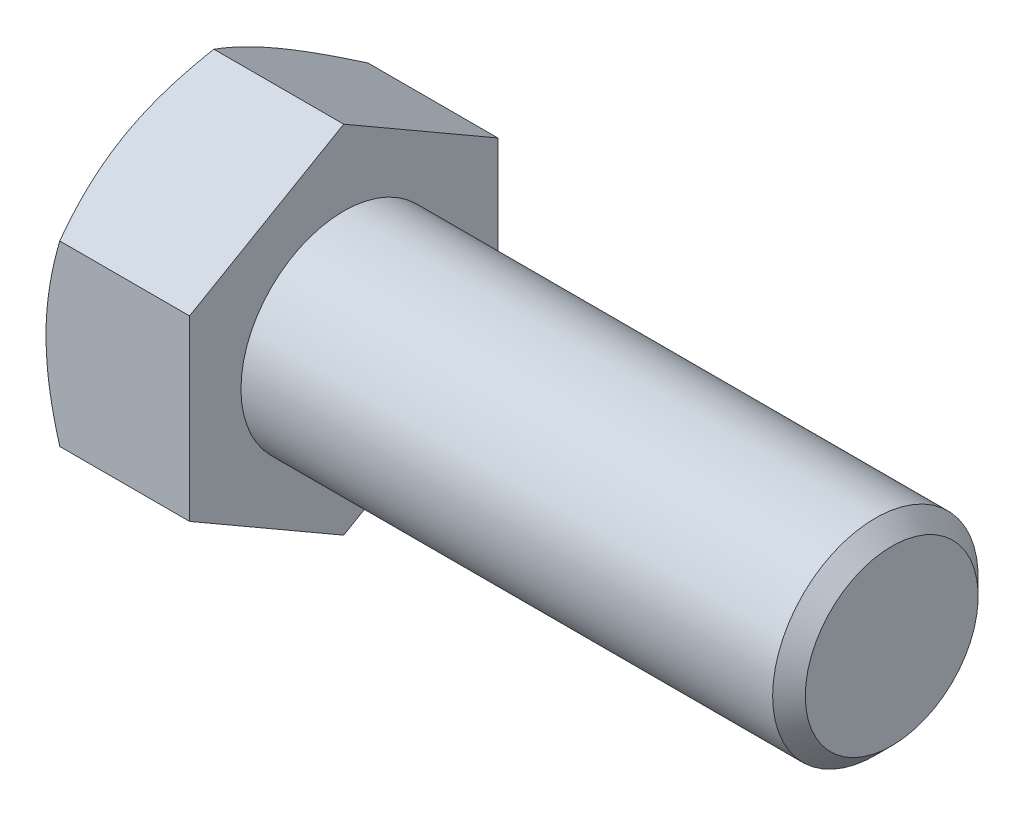
ISO-10303-21;
HEADER;
FILE_DESCRIPTION(('STEP AP214'),'2;1');
FILE_NAME('part.step','',(''),(''),'','','');
FILE_SCHEMA(('AUTOMOTIVE_DESIGN { 1 0 10303 214 1 1 1 1 }'));
ENDSEC;
DATA;
#1=APPLICATION_CONTEXT('core data for automotive mechanical design processes');
#2=APPLICATION_PROTOCOL_DEFINITION('international standard','automotive_design',2000,#1);
#3=PRODUCT_CONTEXT('',#1,'mechanical');
#4=PRODUCT('Part','Part','',(#3));
#5=PRODUCT_RELATED_PRODUCT_CATEGORY('part','',(#4));
#6=PRODUCT_DEFINITION_FORMATION('','',#4);
#7=PRODUCT_DEFINITION_CONTEXT('part definition',#1,'design');
#8=PRODUCT_DEFINITION('design','',#6,#7);
#9=PRODUCT_DEFINITION_SHAPE('','',#8);
#10=(LENGTH_UNIT() NAMED_UNIT(*) SI_UNIT(.MILLI.,.METRE.));
#11=(NAMED_UNIT(*) PLANE_ANGLE_UNIT() SI_UNIT($,.RADIAN.));
#12=(NAMED_UNIT(*) SI_UNIT($,.STERADIAN.) SOLID_ANGLE_UNIT());
#13=UNCERTAINTY_MEASURE_WITH_UNIT(LENGTH_MEASURE(1.E-05),#10,'distance_accuracy_value','');
#14=(GEOMETRIC_REPRESENTATION_CONTEXT(3) GLOBAL_UNCERTAINTY_ASSIGNED_CONTEXT((#13)) GLOBAL_UNIT_ASSIGNED_CONTEXT((#10,
#11,#12)) REPRESENTATION_CONTEXT('',''));
#15=CARTESIAN_POINT('',(0.,0.,0.));
#16=DIRECTION('',(0.,0.,1.));
#17=DIRECTION('',(1.,0.,0.));
#18=AXIS2_PLACEMENT_3D('',#15,#16,#17);
#19=CARTESIAN_POINT('',(13.3096,8.24889197104676,-14.2875));
#20=DIRECTION('',(0.,-0.866025403784438,0.5));
#21=DIRECTION('',(0.,-0.5,-0.866025403784438));
#22=AXIS2_PLACEMENT_3D('',#19,#20,#21);
#23=PLANE('',#22);
#24=CARTESIAN_POINT('',(1.27617469631979,16.4978994121474,0.0002));
#25=CARTESIAN_POINT('',(1.17150354049374,16.316591962665,-0.313833714294311));
#26=CARTESIAN_POINT('',(1.07158215537578,16.1345773166767,-0.629092328867603));
#27=CARTESIAN_POINT('',(0.882559201585302,15.7690884807822,-1.26213756223604));
#28=CARTESIAN_POINT('',(0.793461191524297,15.5856138318553,-1.5799249760784));
#29=CARTESIAN_POINT('',(0.627282646740064,15.2168504028066,-2.21864197116398));
#30=CARTESIAN_POINT('',(0.550230545696848,15.0315583957425,-2.53957714163545));
#31=CARTESIAN_POINT('',(0.409798352887984,14.6596868248225,-3.1836775963594));
#32=CARTESIAN_POINT('',(0.34641748114999,14.4731073350472,-3.50684275230036));
#33=CARTESIAN_POINT('',(0.236023554267064,14.1034416805247,-4.14712244774659));
#34=CARTESIAN_POINT('',(0.188645115273861,13.9203829601652,-4.46418945217785));
#35=CARTESIAN_POINT('',(0.109201912674408,13.5534267067704,-5.0997763272127));
#36=CARTESIAN_POINT('',(0.0771374438271017,13.3695291576584,-5.41829622566206));
#37=CARTESIAN_POINT('',(0.0291317909883664,13.0014251352584,-6.05587109492941));
#38=CARTESIAN_POINT('',(0.0131714475146371,12.8172192908535,-6.37492497648982));
#39=CARTESIAN_POINT('',(-0.00228271550063507,12.448637559964,-7.01332726113215));
#40=CARTESIAN_POINT('',(-0.00177704383827421,12.2642616789095,-7.33267565480881));
#41=CARTESIAN_POINT('',(0.014550680303706,11.9195719861559,-7.92969571550333));
#42=CARTESIAN_POINT('',(0.0283811431962088,11.759233611051,-8.20740992758799));
#43=CARTESIAN_POINT('',(0.0682339694513688,11.4389256760858,-8.76219954501513));
#44=CARTESIAN_POINT('',(0.0942571951847541,11.2789561431174,-9.03927490377954));
#45=CARTESIAN_POINT('',(0.158041814881282,10.9594727825021,-9.59263631653807));
#46=CARTESIAN_POINT('',(0.195812903582825,10.7999594414437,-9.86892152773624));
#47=CARTESIAN_POINT('',(0.28243056247269,10.4816805882453,-10.4201966724507));
#48=CARTESIAN_POINT('',(0.331277885597335,10.3229151276936,-10.6951865166133));
#49=CARTESIAN_POINT('',(0.49566900214655,9.84097374681805,-11.5299334745597));
#50=CARTESIAN_POINT('',(0.627604309461489,9.519193450557,-12.0872732965583));
#51=CARTESIAN_POINT('',(0.927043495545042,8.88043099732143,-13.1936423195297));
#52=CARTESIAN_POINT('',(1.09447704990011,8.56344066203607,-13.7426856857522));
#53=CARTESIAN_POINT('',(1.27617469631978,8.24877650099293,-14.2877));
#54=B_SPLINE_CURVE_WITH_KNOTS('',3,(#24,#25,#26,#27,#28,#29,#30,#31,#32,#33,#34,#35,#36,#37,#38,
#39,#40,#41,#42,#43,#44,#45,#46,#47,#48,#49,#50,#51,#52,#53),.UNSPECIFIED.,.F.,.F.,(4,2,2,2,2,2,
2,2,2,2,2,2,2,2,4),(0.,1.13228866987821,2.26494862244556,3.40024304981971,4.53547268912058,
5.64268215336774,6.74991292800918,7.85582484363026,8.96170258685889,9.92439507576008,
10.8871556643353,11.8507128733959,12.8143356024524,14.7839571212635,16.7497125507192),.UNSPECIFIED.);
#55=CARTESIAN_POINT('',(1.27610802895322,16.4977839420936,0.));
#56=VERTEX_POINT('',#55);
#57=CARTESIAN_POINT('',(0.,12.3733379565702,-7.14375));
#58=VERTEX_POINT('',#57);
#59=EDGE_CURVE('E33',#56,#58,#54,.T.);
#60=ORIENTED_EDGE('',*,*,#59,.F.);
#61=DIRECTION('',(-1.,0.,0.));
#62=VECTOR('',#61,1.);
#63=CARTESIAN_POINT('',(13.3096,16.4977839420936,0.));
#64=LINE('',#63,#62);
#65=CARTESIAN_POINT('',(13.3096,16.4977839420936,0.));
#66=VERTEX_POINT('',#65);
#67=EDGE_CURVE('E129',#66,#56,#64,.T.);
#68=ORIENTED_EDGE('',*,*,#67,.F.);
#69=DIRECTION('',(0.,0.5,0.866025403784438));
#70=VECTOR('',#69,1.);
#71=CARTESIAN_POINT('',(13.3096,8.24889197104676,-14.2875));
#72=LINE('',#71,#70);
#73=CARTESIAN_POINT('',(13.3096,8.24889197104676,-14.2875));
#74=VERTEX_POINT('',#73);
#75=EDGE_CURVE('E214',#74,#66,#72,.T.);
#76=ORIENTED_EDGE('',*,*,#75,.F.);
#77=DIRECTION('',(-1.,0.,0.));
#78=VECTOR('',#77,1.);
#79=CARTESIAN_POINT('',(13.3096,8.24889197104676,-14.2875));
#80=LINE('',#79,#78);
#81=CARTESIAN_POINT('',(1.27610802895321,8.24889197104676,-14.2875));
#82=VERTEX_POINT('',#81);
#83=EDGE_CURVE('E117',#74,#82,#80,.T.);
#84=ORIENTED_EDGE('',*,*,#83,.T.);
#85=EDGE_CURVE('E111',#58,#82,#54,.T.);
#86=ORIENTED_EDGE('',*,*,#85,.F.);
#87=EDGE_LOOP('',(#60,#68,#76,#84,#86));
#88=FACE_BOUND('',#87,.T.);
#89=ADVANCED_FACE('F17',(#88),#23,.F.);
#90=CARTESIAN_POINT('',(13.3096,16.4977839420936,0.));
#91=DIRECTION('',(0.,-0.866025403784438,-0.5));
#92=DIRECTION('',(0.,0.5,-0.866025403784438));
#93=AXIS2_PLACEMENT_3D('',#90,#91,#92);
#94=PLANE('',#93);
#95=CARTESIAN_POINT('',(1.27617469631978,8.24877650099293,14.2877));
#96=CARTESIAN_POINT('',(1.17150354049373,8.43008395047537,13.9736662857057));
#97=CARTESIAN_POINT('',(1.07158215537578,8.61209859646361,13.6584076711324));
#98=CARTESIAN_POINT('',(0.882559201585304,8.97758743235809,13.0253624377639));
#99=CARTESIAN_POINT('',(0.793461191524299,9.16106208128505,12.7075750239216));
#100=CARTESIAN_POINT('',(0.627282646740065,9.5298255103337,12.068858028836));
#101=CARTESIAN_POINT('',(0.55023054569685,9.71511751739782,11.7479228583645));
#102=CARTESIAN_POINT('',(0.409798352887985,10.0869890883179,11.1038224036406));
#103=CARTESIAN_POINT('',(0.346417481149992,10.2735685780931,10.7806572476996));
#104=CARTESIAN_POINT('',(0.236023554267066,10.6432342326156,10.1403775522534));
#105=CARTESIAN_POINT('',(0.188645115273862,10.8262929529751,9.82331054782214));
#106=CARTESIAN_POINT('',(0.10920191267441,11.1932492063699,9.18772367278729));
#107=CARTESIAN_POINT('',(0.0771374438271041,11.3771467554819,8.86920377433793));
#108=CARTESIAN_POINT('',(0.02913179098837,11.7452507778819,8.23162890507058));
#109=CARTESIAN_POINT('',(0.0131714475146414,11.9294566222868,7.91257502351017));
#110=CARTESIAN_POINT('',(-0.00228271550063179,12.2980383531764,7.27417273886784));
#111=CARTESIAN_POINT('',(-0.00177704383827272,12.4824142342309,6.9548243451912));
#112=CARTESIAN_POINT('',(0.0145506803037076,12.8271039269845,6.35780428449668));
#113=CARTESIAN_POINT('',(0.0283811431962119,12.9874423020893,6.08009007241201));
#114=CARTESIAN_POINT('',(0.0682339694513732,13.3077502370545,5.52530045498486));
#115=CARTESIAN_POINT('',(0.0942571951847582,13.4677197700229,5.24822509622045));
#116=CARTESIAN_POINT('',(0.158041814881286,13.7872031306382,4.69486368346192));
#117=CARTESIAN_POINT('',(0.195812903582829,13.9467164716966,4.41857847226376));
#118=CARTESIAN_POINT('',(0.282430562472695,14.264995324895,3.86730332754926));
#119=CARTESIAN_POINT('',(0.331277885597339,14.4237607854467,3.59231348338674));
#120=CARTESIAN_POINT('',(0.495669002146554,14.9057021663223,2.75756652544034));
#121=CARTESIAN_POINT('',(0.627604309461494,15.2274824625833,2.20022670344164));
#122=CARTESIAN_POINT('',(0.927043495545049,15.8662449158189,1.09385768047029));
#123=CARTESIAN_POINT('',(1.09447704990012,16.1832352511043,0.544814314247755));
#124=CARTESIAN_POINT('',(1.27617469631979,16.4978994121474,-0.000200000000001206));
#125=B_SPLINE_CURVE_WITH_KNOTS('',3,(#95,#96,#97,#98,#99,#100,#101,#102,#103,#104,#105,#106,
#107,#108,#109,#110,#111,#112,#113,#114,#115,#116,#117,#118,#119,#120,#121,#122,#123,#124),
.UNSPECIFIED.,.F.,.F.,(4,2,2,2,2,2,2,2,2,2,2,2,2,2,4),(0.,1.1322886698782,2.26494862244556,
3.4002430498197,4.53547268912058,5.64268215336774,6.74991292800917,7.85582484363026,
8.96170258685889,9.92439507576008,10.8871556643353,11.8507128733959,12.8143356024524,
14.7839571212635,16.7497125507192),.UNSPECIFIED.);
#126=CARTESIAN_POINT('',(1.27610802895321,8.24889197104677,14.2875));
#127=VERTEX_POINT('',#126);
#128=CARTESIAN_POINT('',(0.,12.3733379565702,7.14375));
#129=VERTEX_POINT('',#128);
#130=EDGE_CURVE('E40',#127,#129,#125,.T.);
#131=ORIENTED_EDGE('',*,*,#130,.F.);
#132=DIRECTION('',(-1.,0.,0.));
#133=VECTOR('',#132,1.);
#134=CARTESIAN_POINT('',(13.3096,8.24889197104677,14.2875));
#135=LINE('',#134,#133);
#136=CARTESIAN_POINT('',(13.3096,8.24889197104677,14.2875));
#137=VERTEX_POINT('',#136);
#138=EDGE_CURVE('E127',#137,#127,#135,.T.);
#139=ORIENTED_EDGE('',*,*,#138,.F.);
#140=DIRECTION('',(0.,-0.5,0.866025403784438));
#141=VECTOR('',#140,1.);
#142=CARTESIAN_POINT('',(13.3096,16.4977839420936,0.));
#143=LINE('',#142,#141);
#144=EDGE_CURVE('E212',#66,#137,#143,.T.);
#145=ORIENTED_EDGE('',*,*,#144,.F.);
#146=ORIENTED_EDGE('',*,*,#67,.T.);
#147=EDGE_CURVE('E144',#129,#56,#125,.T.);
#148=ORIENTED_EDGE('',*,*,#147,.F.);
#149=EDGE_LOOP('',(#131,#139,#145,#146,#148));
#150=FACE_BOUND('',#149,.T.);
#151=ADVANCED_FACE('F150',(#150),#94,.F.);
#152=CARTESIAN_POINT('',(13.3096,8.24889197104677,14.2875));
#153=DIRECTION('',(0.,0.,-1.));
#154=DIRECTION('',(0.,1.,0.));
#155=AXIS2_PLACEMENT_3D('',#152,#153,#154);
#156=PLANE('',#155);
#157=CARTESIAN_POINT('',(7.08559653091284,-22.3898851403976,14.2875));
#158=CARTESIAN_POINT('',(6.93326774728015,-22.0768961485065,14.2875));
#159=CARTESIAN_POINT('',(6.78168115524726,-21.7635461076253,14.2875));
#160=CARTESIAN_POINT('',(6.48015999479452,-21.1360486675518,14.2875));
#161=CARTESIAN_POINT('',(6.33022544229007,-20.8219012607137,14.2875));
#162=CARTESIAN_POINT('',(5.88311326936992,-19.8780695997121,14.2875));
#163=CARTESIAN_POINT('',(5.5886705911187,-19.2470849579339,14.2875));
#164=CARTESIAN_POINT('',(5.00727922083416,-17.9776461473272,14.2875));
#165=CARTESIAN_POINT('',(4.72037808476412,-17.3391701473184,14.2875));
#166=CARTESIAN_POINT('',(4.15800525940536,-16.0572214756456,14.2875));
#167=CARTESIAN_POINT('',(3.88253304540859,-15.4137490349848,14.2875));
#168=CARTESIAN_POINT('',(3.33703966758479,-14.0991063623122,14.2875));
#169=CARTESIAN_POINT('',(3.06751087102778,-13.427730783812,14.2875));
#170=CARTESIAN_POINT('',(2.5482941470189,-12.0772064856565,14.2875));
#171=CARTESIAN_POINT('',(2.29860841369514,-11.3980569158718,14.2875));
#172=CARTESIAN_POINT('',(1.82546713347175,-10.0321237241471,14.2875));
#173=CARTESIAN_POINT('',(1.60196042520997,-9.34535796384213,14.2875));
#174=CARTESIAN_POINT('',(1.18818152853813,-7.96191308991343,14.2875));
#175=CARTESIAN_POINT('',(0.997899114310357,-7.2652370981213,14.2875));
#176=CARTESIAN_POINT('',(0.744688974538716,-6.21459800125068,14.2875));
#177=CARTESIAN_POINT('',(0.665833592890648,-5.86445181168121,14.2875));
#178=CARTESIAN_POINT('',(0.519775761529065,-5.16172478937003,14.2875));
#179=CARTESIAN_POINT('',(0.452573084094938,-4.80914400434596,14.2875));
#180=CARTESIAN_POINT('',(0.330991997803053,-4.10177331465976,14.2875));
#181=CARTESIAN_POINT('',(0.276613366867468,-3.74698344836219,14.2875));
#182=CARTESIAN_POINT('',(0.181756259237047,-3.03555342863083,14.2875));
#183=CARTESIAN_POINT('',(0.141277163865968,-2.67891335826815,14.2875));
#184=CARTESIAN_POINT('',(0.0755436500454314,-1.96903610663559,14.2875));
#185=CARTESIAN_POINT('',(0.0500928077740657,-1.61581722652351,14.2875));
#186=CARTESIAN_POINT('',(0.0141622343995995,-0.908619532356749,14.2875));
#187=CARTESIAN_POINT('',(0.00368224833251705,-0.554640731346863,14.2875));
#188=CARTESIAN_POINT('',(-0.00205625515740598,0.153442979231275,14.2875));
#189=CARTESIAN_POINT('',(0.00268522427340313,0.507547888773444,14.2875));
#190=CARTESIAN_POINT('',(0.0272712917644393,1.21523734452439,14.2875));
#191=CARTESIAN_POINT('',(0.0471165519035001,1.56882186687579,14.2875));
#192=CARTESIAN_POINT('',(0.11199603107171,2.41165837977563,14.2875));
#193=CARTESIAN_POINT('',(0.163810406450372,2.90039811194564,14.2875));
#194=CARTESIAN_POINT('',(0.293528569466133,3.87440480488912,14.2875));
#195=CARTESIAN_POINT('',(0.371435712647268,4.35967131080168,14.2875));
#196=CARTESIAN_POINT('',(0.550568352001126,5.32621625313485,14.2875));
#197=CARTESIAN_POINT('',(0.651811306760679,5.8074914227673,14.2875));
#198=CARTESIAN_POINT('',(0.87451337427602,6.7652906867346,14.2875));
#199=CARTESIAN_POINT('',(0.995972236678842,7.24181483982839,14.2875));
#200=CARTESIAN_POINT('',(1.259051674178,8.20075205778831,14.2875));
#201=CARTESIAN_POINT('',(1.40106388456013,8.68305692684693,14.2875));
#202=CARTESIAN_POINT('',(1.70023403432787,9.64291929226155,14.2875));
#203=CARTESIAN_POINT('',(1.85739207777891,10.1204767559738,14.2875));
#204=CARTESIAN_POINT('',(2.18431745757465,11.071072312766,14.2875));
#205=CARTESIAN_POINT('',(2.35408093456884,11.5441117394621,14.2875));
#206=CARTESIAN_POINT('',(2.7041737523253,12.4862394675866,14.2875));
#207=CARTESIAN_POINT('',(2.8845029427673,12.955327825119,14.2875));
#208=CARTESIAN_POINT('',(3.33642274249975,14.0985450123052,14.2875));
#209=CARTESIAN_POINT('',(3.61283070485536,14.7707670956111,14.2875));
#210=CARTESIAN_POINT('',(4.17998789378482,16.1091534086177,14.2875));
#211=CARTESIAN_POINT('',(4.47073818030502,16.7753171862674,14.2875));
#212=CARTESIAN_POINT('',(5.06358550000994,18.1027741716843,14.2875));
#213=CARTESIAN_POINT('',(5.36568552575699,18.7640660391257,14.2875));
#214=CARTESIAN_POINT('',(5.97884038094199,20.0824528287766,14.2875));
#215=CARTESIAN_POINT('',(6.28989497805703,20.7395478593321,14.2875));
#216=CARTESIAN_POINT('',(6.91960732570603,22.0510812939212,14.2875));
#217=CARTESIAN_POINT('',(7.23827402908065,22.7055153913756,14.2875));
#218=CARTESIAN_POINT('',(7.88149356008954,24.0114843998787,14.2875));
#219=CARTESIAN_POINT('',(8.20604641853122,24.663019295731,14.2875));
#220=CARTESIAN_POINT('',(8.85994319829524,25.9635553617577,14.2875));
#221=CARTESIAN_POINT('',(9.18928639403452,26.6125568971502,14.2875));
#222=CARTESIAN_POINT('',(9.85199752739624,27.9084978324256,14.2875));
#223=CARTESIAN_POINT('',(10.1853654561409,28.555437236853,14.2875));
#224=CARTESIAN_POINT('',(11.1306522678145,30.3782153849138,14.2875));
#225=CARTESIAN_POINT('',(11.7464658067759,31.5520342270543,14.2875));
#226=CARTESIAN_POINT('',(12.9863637492688,33.8953480220263,14.2875));
#227=CARTESIAN_POINT('',(13.6104484992592,35.0648427910931,14.2875));
#228=CARTESIAN_POINT('',(14.8631697843525,37.3972192211192,14.2875));
#229=CARTESIAN_POINT('',(15.4917889329957,38.5601102267932,14.2875));
#230=CARTESIAN_POINT('',(16.4383496296699,40.3024250307733,14.2875));
#231=CARTESIAN_POINT('',(16.7544655515047,40.8828421143772,14.2875));
#232=CARTESIAN_POINT('',(17.3877853934411,42.0430813057571,14.2875));
#233=CARTESIAN_POINT('',(17.7049893118937,42.6229034144332,14.2875));
#234=CARTESIAN_POINT('',(18.0226732632783,43.2024624684083,14.2875));
#235=B_SPLINE_CURVE_WITH_KNOTS('',3,(#157,#158,#159,#160,#161,#162,#163,#164,#165,#166,#167,
#168,#169,#170,#171,#172,#173,#174,#175,#176,#177,#178,#179,#180,#181,#182,#183,#184,#185,#186,
#187,#188,#189,#190,#191,#192,#193,#194,#195,#196,#197,#198,#199,#200,#201,#202,#203,#204,#205,
#206,#207,#208,#209,#210,#211,#212,#213,#214,#215,#216,#217,#218,#219,#220,#221,#222,#223,#224,
#225,#226,#227,#228,#229,#230,#231,#232,#233,#234),.UNSPECIFIED.,.F.,.F.,(4,2,2,2,2,2,2,2,2,2,2,
2,2,2,2,2,2,2,2,2,2,2,2,2,2,2,2,2,2,2,2,2,2,2,2,2,2,2,4),(0.,1.04426611026884,2.08854227199574,
4.17739185153994,6.27722701936103,8.37696567568248,10.5470989949833,12.7174719418313,
14.8835299683504,17.048920142941,18.1255049291752,19.2020686740974,20.2786137744758,
21.3551109510055,22.4172073060167,23.4792855725806,24.5413636196078,25.6034889291002,
27.0771146749695,28.5509300027185,30.0258515587195,31.5007548507115,33.0087918261306,
34.5168391638508,36.024426678107,37.5319927488533,39.7122554194619,41.8926794609792,
44.0736825017389,46.2546290081198,48.4382809122898,50.6219442487211,52.8052802048644,
54.9886113458608,58.9652044042268,62.9419645611425,66.9077143187838,68.8904689713397,
70.8732206202618),.UNSPECIFIED.);
#236=CARTESIAN_POINT('',(1.27610802895321,-8.24889197104675,14.2875));
#237=VERTEX_POINT('',#236);
#238=CARTESIAN_POINT('',(0.,0.,14.2875));
#239=VERTEX_POINT('',#238);
#240=EDGE_CURVE('E224',#237,#239,#235,.T.);
#241=ORIENTED_EDGE('',*,*,#240,.F.);
#242=DIRECTION('',(-1.,0.,0.));
#243=VECTOR('',#242,1.);
#244=CARTESIAN_POINT('',(13.3096,-8.24889197104675,14.2875));
#245=LINE('',#244,#243);
#246=CARTESIAN_POINT('',(13.3096,-8.24889197104675,14.2875));
#247=VERTEX_POINT('',#246);
#248=EDGE_CURVE('E119',#247,#237,#245,.T.);
#249=ORIENTED_EDGE('',*,*,#248,.F.);
#250=DIRECTION('',(0.,-1.,0.));
#251=VECTOR('',#250,1.);
#252=CARTESIAN_POINT('',(13.3096,8.24889197104677,14.2875));
#253=LINE('',#252,#251);
#254=EDGE_CURVE('E208',#137,#247,#253,.T.);
#255=ORIENTED_EDGE('',*,*,#254,.F.);
#256=ORIENTED_EDGE('',*,*,#138,.T.);
#257=EDGE_CURVE('E166',#239,#127,#235,.T.);
#258=ORIENTED_EDGE('',*,*,#257,.F.);
#259=EDGE_LOOP('',(#241,#249,#255,#256,#258));
#260=FACE_BOUND('',#259,.T.);
#261=ADVANCED_FACE('F230',(#260),#156,.F.);
#262=CARTESIAN_POINT('',(13.3096,-16.4977839420936,0.));
#263=DIRECTION('',(0.,0.866025403784437,-0.5));
#264=DIRECTION('',(0.,0.5,0.866025403784438));
#265=AXIS2_PLACEMENT_3D('',#262,#263,#264);
#266=PLANE('',#265);
#267=CARTESIAN_POINT('',(1.2761746963198,-16.4978994121474,-0.000200000000000067));
#268=CARTESIAN_POINT('',(1.17150354049374,-16.316591962665,0.313833714294313));
#269=CARTESIAN_POINT('',(1.07158215537578,-16.1345773166767,0.629092328867605));
#270=CARTESIAN_POINT('',(0.882559201585305,-15.7690884807822,1.26213756223604));
#271=CARTESIAN_POINT('',(0.7934611915243,-15.5856138318553,1.5799249760784));
#272=CARTESIAN_POINT('',(0.627282646740067,-15.2168504028066,2.21864197116397));
#273=CARTESIAN_POINT('',(0.550230545696852,-15.0315583957425,2.53957714163545));
#274=CARTESIAN_POINT('',(0.409798352887987,-14.6596868248225,3.1836775963594));
#275=CARTESIAN_POINT('',(0.346417481149993,-14.4731073350472,3.50684275230035));
#276=CARTESIAN_POINT('',(0.236023554267066,-14.1034416805247,4.14712244774659));
#277=CARTESIAN_POINT('',(0.188645115273863,-13.9203829601652,4.46418945217785));
#278=CARTESIAN_POINT('',(0.109201912674409,-13.5534267067704,5.0997763272127));
#279=CARTESIAN_POINT('',(0.0771374438271033,-13.3695291576584,5.41829622566206));
#280=CARTESIAN_POINT('',(0.0291317909883688,-13.0014251352584,6.05587109492941));
#281=CARTESIAN_POINT('',(0.01317144751464,-12.8172192908535,6.37492497648982));
#282=CARTESIAN_POINT('',(-0.00228271550063391,-12.448637559964,7.01332726113215));
#283=CARTESIAN_POINT('',(-0.00177704383827524,-12.2642616789095,7.3326756548088));
#284=CARTESIAN_POINT('',(0.0145506803037046,-11.9195719861559,7.92969571550332));
#285=CARTESIAN_POINT('',(0.0283811431962088,-11.759233611051,8.20740992758799));
#286=CARTESIAN_POINT('',(0.0682339694513693,-11.4389256760858,8.76219954501513));
#287=CARTESIAN_POINT('',(0.0942571951847536,-11.2789561431174,9.03927490377953));
#288=CARTESIAN_POINT('',(0.15804181488128,-10.9594727825021,9.59263631653807));
#289=CARTESIAN_POINT('',(0.195812903582824,-10.7999594414437,9.86892152773623));
#290=CARTESIAN_POINT('',(0.282430562472689,-10.4816805882453,10.4201966724507));
#291=CARTESIAN_POINT('',(0.331277885597334,-10.3229151276936,10.6951865166133));
#292=CARTESIAN_POINT('',(0.495669002146551,-9.84097374681805,11.5299334745597));
#293=CARTESIAN_POINT('',(0.627604309461491,-9.519193450557,12.0872732965584));
#294=CARTESIAN_POINT('',(0.927043495545044,-8.88043099732142,13.1936423195297));
#295=CARTESIAN_POINT('',(1.09447704990011,-8.56344066203606,13.7426856857522));
#296=CARTESIAN_POINT('',(1.27617469631978,-8.24877650099291,14.2877));
#297=B_SPLINE_CURVE_WITH_KNOTS('',3,(#267,#268,#269,#270,#271,#272,#273,#274,#275,#276,#277,
#278,#279,#280,#281,#282,#283,#284,#285,#286,#287,#288,#289,#290,#291,#292,#293,#294,#295,#296),
.UNSPECIFIED.,.F.,.F.,(4,2,2,2,2,2,2,2,2,2,2,2,2,2,4),(0.,1.1322886698782,2.26494862244556,
3.4002430498197,4.53547268912058,5.64268215336774,6.74991292800917,7.85582484363026,
8.96170258685889,9.92439507576008,10.8871556643353,11.8507128733959,12.8143356024524,
14.7839571212635,16.7497125507192),.UNSPECIFIED.);
#298=CARTESIAN_POINT('',(1.27610802895322,-16.4977839420936,0.));
#299=VERTEX_POINT('',#298);
#300=CARTESIAN_POINT('',(0.,-12.3733379565701,7.14375));
#301=VERTEX_POINT('',#300);
#302=EDGE_CURVE('E152',#299,#301,#297,.T.);
#303=ORIENTED_EDGE('',*,*,#302,.F.);
#304=DIRECTION('',(-1.,0.,0.));
#305=VECTOR('',#304,1.);
#306=CARTESIAN_POINT('',(13.3096,-16.4977839420936,0.));
#307=LINE('',#306,#305);
#308=CARTESIAN_POINT('',(13.3096,-16.4977839420936,0.));
#309=VERTEX_POINT('',#308);
#310=EDGE_CURVE('E116',#309,#299,#307,.T.);
#311=ORIENTED_EDGE('',*,*,#310,.F.);
#312=DIRECTION('',(0.,-0.5,-0.866025403784438));
#313=VECTOR('',#312,1.);
#314=CARTESIAN_POINT('',(13.3096,-16.4977839420936,0.));
#315=LINE('',#314,#313);
#316=EDGE_CURVE('E206',#247,#309,#315,.T.);
#317=ORIENTED_EDGE('',*,*,#316,.F.);
#318=ORIENTED_EDGE('',*,*,#248,.T.);
#319=EDGE_CURVE('E154',#301,#237,#297,.T.);
#320=ORIENTED_EDGE('',*,*,#319,.F.);
#321=EDGE_LOOP('',(#303,#311,#317,#318,#320));
#322=FACE_BOUND('',#321,.T.);
#323=ADVANCED_FACE('F202',(#322),#266,.F.);
#324=CARTESIAN_POINT('',(13.3096,-8.2488919710468,-14.2875));
#325=DIRECTION('',(0.,0.866025403784439,0.5));
#326=DIRECTION('',(0.,-0.5,0.866025403784439));
#327=AXIS2_PLACEMENT_3D('',#324,#325,#326);
#328=PLANE('',#327);
#329=CARTESIAN_POINT('',(1.27617469631979,-8.24877650099296,-14.2877));
#330=CARTESIAN_POINT('',(1.17150354049374,-8.4300839504754,-13.9736662857057));
#331=CARTESIAN_POINT('',(1.07158215537579,-8.61209859646364,-13.6584076711324));
#332=CARTESIAN_POINT('',(0.882559201585316,-8.97758743235812,-13.0253624377639));
#333=CARTESIAN_POINT('',(0.79346119152431,-9.16106208128508,-12.7075750239216));
#334=CARTESIAN_POINT('',(0.627282646740076,-9.52982551033373,-12.068858028836));
#335=CARTESIAN_POINT('',(0.550230545696861,-9.71511751739785,-11.7479228583645));
#336=CARTESIAN_POINT('',(0.409798352887998,-10.0869890883179,-11.1038224036406));
#337=CARTESIAN_POINT('',(0.346417481150006,-10.2735685780931,-10.7806572476996));
#338=CARTESIAN_POINT('',(0.23602355426708,-10.6432342326156,-10.1403775522534));
#339=CARTESIAN_POINT('',(0.188645115273876,-10.8262929529752,-9.82331054782214));
#340=CARTESIAN_POINT('',(0.109201912674422,-11.1932492063699,-9.18772367278729));
#341=CARTESIAN_POINT('',(0.0771374438271171,-11.3771467554819,-8.86920377433793));
#342=CARTESIAN_POINT('',(0.0291317909883845,-11.745250777882,-8.23162890507058));
#343=CARTESIAN_POINT('',(0.013171447514657,-11.9294566222869,-7.91257502351018));
#344=CARTESIAN_POINT('',(-0.00228271550061935,-12.2980383531764,-7.27417273886784));
#345=CARTESIAN_POINT('',(-0.00177704383826439,-12.4824142342309,-6.95482434519119));
#346=CARTESIAN_POINT('',(0.0145506803037171,-12.8271039269845,-6.35780428449667));
#347=CARTESIAN_POINT('',(0.0283811431962256,-12.9874423020893,-6.08009007241201));
#348=CARTESIAN_POINT('',(0.0682339694513894,-13.3077502370545,-5.52530045498487));
#349=CARTESIAN_POINT('',(0.0942571951847727,-13.4677197700229,-5.24822509622046));
#350=CARTESIAN_POINT('',(0.158041814881299,-13.7872031306382,-4.69486368346193));
#351=CARTESIAN_POINT('',(0.195812903582843,-13.9467164716966,-4.41857847226376));
#352=CARTESIAN_POINT('',(0.282430562472708,-14.2649953248951,-3.86730332754927));
#353=CARTESIAN_POINT('',(0.331277885597352,-14.4237607854467,-3.59231348338674));
#354=CARTESIAN_POINT('',(0.495669002146568,-14.9057021663223,-2.75756652544035));
#355=CARTESIAN_POINT('',(0.627604309461508,-15.2274824625833,-2.20022670344165));
#356=CARTESIAN_POINT('',(0.92704349554506,-15.8662449158189,-1.0938576804703));
#357=CARTESIAN_POINT('',(1.09447704990012,-16.1832352511043,-0.544814314247761));
#358=CARTESIAN_POINT('',(1.2761746963198,-16.4978994121474,0.000200000000000622));
#359=B_SPLINE_CURVE_WITH_KNOTS('',3,(#329,#330,#331,#332,#333,#334,#335,#336,#337,#338,#339,
#340,#341,#342,#343,#344,#345,#346,#347,#348,#349,#350,#351,#352,#353,#354,#355,#356,#357,#358),
.UNSPECIFIED.,.F.,.F.,(4,2,2,2,2,2,2,2,2,2,2,2,2,2,4),(0.,1.1322886698782,2.26494862244556,
3.4002430498197,4.53547268912058,5.64268215336774,6.74991292800917,7.85582484363026,
8.96170258685888,9.92439507576007,10.8871556643353,11.8507128733959,12.8143356024524,
14.7839571212635,16.7497125507192),.UNSPECIFIED.);
#360=CARTESIAN_POINT('',(1.27610802895322,-8.2488919710468,-14.2875));
#361=VERTEX_POINT('',#360);
#362=CARTESIAN_POINT('',(0.,-12.3733379565702,-7.14375));
#363=VERTEX_POINT('',#362);
#364=EDGE_CURVE('E93',#361,#363,#359,.T.);
#365=ORIENTED_EDGE('',*,*,#364,.F.);
#366=DIRECTION('',(-1.,0.,0.));
#367=VECTOR('',#366,1.);
#368=CARTESIAN_POINT('',(13.3096,-8.2488919710468,-14.2875));
#369=LINE('',#368,#367);
#370=CARTESIAN_POINT('',(13.3096,-8.2488919710468,-14.2875));
#371=VERTEX_POINT('',#370);
#372=EDGE_CURVE('E107',#371,#361,#369,.T.);
#373=ORIENTED_EDGE('',*,*,#372,.F.);
#374=DIRECTION('',(0.,0.5,-0.866025403784439));
#375=VECTOR('',#374,1.);
#376=CARTESIAN_POINT('',(13.3096,-8.2488919710468,-14.2875));
#377=LINE('',#376,#375);
#378=EDGE_CURVE('E204',#309,#371,#377,.T.);
#379=ORIENTED_EDGE('',*,*,#378,.F.);
#380=ORIENTED_EDGE('',*,*,#310,.T.);
#381=EDGE_CURVE('E110',#363,#299,#359,.T.);
#382=ORIENTED_EDGE('',*,*,#381,.F.);
#383=EDGE_LOOP('',(#365,#373,#379,#380,#382));
#384=FACE_BOUND('',#383,.T.);
#385=ADVANCED_FACE('F105',(#384),#328,.F.);
#386=CARTESIAN_POINT('',(13.3096,8.24889197104676,-14.2875));
#387=DIRECTION('',(0.,0.,1.));
#388=DIRECTION('',(0.,-1.,0.));
#389=AXIS2_PLACEMENT_3D('',#386,#387,#388);
#390=PLANE('',#389);
#391=CARTESIAN_POINT('',(7.08559653091287,-22.3898851403977,-14.2875));
#392=CARTESIAN_POINT('',(6.93326774728018,-22.0768961485065,-14.2875));
#393=CARTESIAN_POINT('',(6.78168115524728,-21.7635461076253,-14.2875));
#394=CARTESIAN_POINT('',(6.48015999479454,-21.1360486675519,-14.2875));
#395=CARTESIAN_POINT('',(6.3302254422901,-20.8219012607137,-14.2875));
#396=CARTESIAN_POINT('',(5.88311326936994,-19.8780695997121,-14.2875));
#397=CARTESIAN_POINT('',(5.58867059111872,-19.247084957934,-14.2875));
#398=CARTESIAN_POINT('',(5.00727922083418,-17.9776461473273,-14.2875));
#399=CARTESIAN_POINT('',(4.72037808476414,-17.3391701473184,-14.2875));
#400=CARTESIAN_POINT('',(4.15800525940538,-16.0572214756457,-14.2875));
#401=CARTESIAN_POINT('',(3.88253304540861,-15.4137490349849,-14.2875));
#402=CARTESIAN_POINT('',(3.3370396675848,-14.0991063623123,-14.2875));
#403=CARTESIAN_POINT('',(3.06751087102779,-13.427730783812,-14.2875));
#404=CARTESIAN_POINT('',(2.54829414701892,-12.0772064856565,-14.2875));
#405=CARTESIAN_POINT('',(2.29860841369515,-11.3980569158718,-14.2875));
#406=CARTESIAN_POINT('',(1.82546713347176,-10.0321237241472,-14.2875));
#407=CARTESIAN_POINT('',(1.60196042520998,-9.34535796384217,-14.2875));
#408=CARTESIAN_POINT('',(1.18818152853815,-7.96191308991347,-14.2875));
#409=CARTESIAN_POINT('',(0.99789911431037,-7.26523709812134,-14.2875));
#410=CARTESIAN_POINT('',(0.744688974538727,-6.21459800125072,-14.2875));
#411=CARTESIAN_POINT('',(0.665833592890657,-5.86445181168125,-14.2875));
#412=CARTESIAN_POINT('',(0.519775761529072,-5.16172478937007,-14.2875));
#413=CARTESIAN_POINT('',(0.452573084094944,-4.809144004346,-14.2875));
#414=CARTESIAN_POINT('',(0.330991997803059,-4.1017733146598,-14.2875));
#415=CARTESIAN_POINT('',(0.276613366867474,-3.74698344836222,-14.2875));
#416=CARTESIAN_POINT('',(0.181756259237052,-3.03555342863086,-14.2875));
#417=CARTESIAN_POINT('',(0.141277163865972,-2.67891335826818,-14.2875));
#418=CARTESIAN_POINT('',(0.0755436500454339,-1.96903610663562,-14.2875));
#419=CARTESIAN_POINT('',(0.0500928077740681,-1.61581722652355,-14.2875));
#420=CARTESIAN_POINT('',(0.014162234399601,-0.908619532356782,-14.2875));
#421=CARTESIAN_POINT('',(0.00368224833251767,-0.554640731346894,-14.2875));
#422=CARTESIAN_POINT('',(-0.00205625515740659,0.153442979231244,-14.2875));
#423=CARTESIAN_POINT('',(0.00268522427340212,0.507547888773414,-14.2875));
#424=CARTESIAN_POINT('',(0.0272712917644383,1.21523734452436,-14.2875));
#425=CARTESIAN_POINT('',(0.0471165519034995,1.56882186687576,-14.2875));
#426=CARTESIAN_POINT('',(0.111996031071709,2.4116583797756,-14.2875));
#427=CARTESIAN_POINT('',(0.163810406450368,2.90039811194561,-14.2875));
#428=CARTESIAN_POINT('',(0.293528569466127,3.87440480488909,-14.2875));
#429=CARTESIAN_POINT('',(0.371435712647261,4.35967131080164,-14.2875));
#430=CARTESIAN_POINT('',(0.550568352001119,5.32621625313482,-14.2875));
#431=CARTESIAN_POINT('',(0.651811306760672,5.80749142276727,-14.2875));
#432=CARTESIAN_POINT('',(0.874513374276013,6.76529068673457,-14.2875));
#433=CARTESIAN_POINT('',(0.995972236678835,7.24181483982836,-14.2875));
#434=CARTESIAN_POINT('',(1.25905167417799,8.20075205778827,-14.2875));
#435=CARTESIAN_POINT('',(1.40106388456011,8.6830569268469,-14.2875));
#436=CARTESIAN_POINT('',(1.70023403432786,9.64291929226152,-14.2875));
#437=CARTESIAN_POINT('',(1.8573920777789,10.1204767559737,-14.2875));
#438=CARTESIAN_POINT('',(2.18431745757464,11.071072312766,-14.2875));
#439=CARTESIAN_POINT('',(2.35408093456883,11.544111739462,-14.2875));
#440=CARTESIAN_POINT('',(2.70417375232529,12.4862394675865,-14.2875));
#441=CARTESIAN_POINT('',(2.88450294276728,12.9553278251189,-14.2875));
#442=CARTESIAN_POINT('',(3.33642274249973,14.0985450123052,-14.2875));
#443=CARTESIAN_POINT('',(3.61283070485534,14.770767095611,-14.2875));
#444=CARTESIAN_POINT('',(4.1799878937848,16.1091534086177,-14.2875));
#445=CARTESIAN_POINT('',(4.470738180305,16.7753171862674,-14.2875));
#446=CARTESIAN_POINT('',(5.06358550000992,18.1027741716843,-14.2875));
#447=CARTESIAN_POINT('',(5.36568552575698,18.7640660391256,-14.2875));
#448=CARTESIAN_POINT('',(5.97884038094198,20.0824528287766,-14.2875));
#449=CARTESIAN_POINT('',(6.28989497805701,20.7395478593321,-14.2875));
#450=CARTESIAN_POINT('',(6.91960732570602,22.0510812939211,-14.2875));
#451=CARTESIAN_POINT('',(7.23827402908063,22.7055153913756,-14.2875));
#452=CARTESIAN_POINT('',(7.88149356008953,24.0114843998787,-14.2875));
#453=CARTESIAN_POINT('',(8.20604641853121,24.6630192957309,-14.2875));
#454=CARTESIAN_POINT('',(8.85994319829523,25.9635553617576,-14.2875));
#455=CARTESIAN_POINT('',(9.1892863940345,26.6125568971502,-14.2875));
#456=CARTESIAN_POINT('',(9.85199752739623,27.9084978324255,-14.2875));
#457=CARTESIAN_POINT('',(10.1853654561409,28.555437236853,-14.2875));
#458=CARTESIAN_POINT('',(11.1306522678145,30.3782153849138,-14.2875));
#459=CARTESIAN_POINT('',(11.7464658067758,31.5520342270543,-14.2875));
#460=CARTESIAN_POINT('',(12.9863637492688,33.8953480220263,-14.2875));
#461=CARTESIAN_POINT('',(13.6104484992592,35.0648427910931,-14.2875));
#462=CARTESIAN_POINT('',(14.8631697843525,37.3972192211191,-14.2875));
#463=CARTESIAN_POINT('',(15.4917889329957,38.5601102267932,-14.2875));
#464=CARTESIAN_POINT('',(16.4383496296699,40.3024250307733,-14.2875));
#465=CARTESIAN_POINT('',(16.7544655515047,40.8828421143772,-14.2875));
#466=CARTESIAN_POINT('',(17.3877853934411,42.0430813057571,-14.2875));
#467=CARTESIAN_POINT('',(17.7049893118937,42.6229034144332,-14.2875));
#468=CARTESIAN_POINT('',(18.0226732632783,43.2024624684083,-14.2875));
#469=B_SPLINE_CURVE_WITH_KNOTS('',3,(#391,#392,#393,#394,#395,#396,#397,#398,#399,#400,#401,
#402,#403,#404,#405,#406,#407,#408,#409,#410,#411,#412,#413,#414,#415,#416,#417,#418,#419,#420,
#421,#422,#423,#424,#425,#426,#427,#428,#429,#430,#431,#432,#433,#434,#435,#436,#437,#438,#439,
#440,#441,#442,#443,#444,#445,#446,#447,#448,#449,#450,#451,#452,#453,#454,#455,#456,#457,#458,
#459,#460,#461,#462,#463,#464,#465,#466,#467,#468),.UNSPECIFIED.,.F.,.F.,(4,2,2,2,2,2,2,2,2,2,2,
2,2,2,2,2,2,2,2,2,2,2,2,2,2,2,2,2,2,2,2,2,2,2,2,2,2,2,4),(0.,1.04426611026885,2.08854227199574,
4.17739185153995,6.27722701936104,8.37696567568249,10.5470989949833,12.7174719418313,
14.8835299683505,17.048920142941,18.1255049291752,19.2020686740974,20.2786137744759,
21.3551109510055,22.4172073060168,23.4792855725806,24.5413636196078,25.6034889291002,
27.0771146749695,28.5509300027185,30.0258515587195,31.5007548507116,33.0087918261307,
34.5168391638508,36.024426678107,37.5319927488533,39.7122554194619,41.8926794609792,
44.0736825017389,46.2546290081198,48.4382809122899,50.6219442487212,52.8052802048644,
54.9886113458609,58.9652044042268,62.9419645611426,66.9077143187839,68.8904689713398,
70.8732206202619),.UNSPECIFIED.);
#470=CARTESIAN_POINT('',(0.,0.,-14.2875));
#471=VERTEX_POINT('',#470);
#472=EDGE_CURVE('E99',#82,#471,#469,.F.);
#473=ORIENTED_EDGE('',*,*,#472,.F.);
#474=ORIENTED_EDGE('',*,*,#83,.F.);
#475=DIRECTION('',(0.,1.,0.));
#476=VECTOR('',#475,1.);
#477=CARTESIAN_POINT('',(13.3096,8.24889197104676,-14.2875));
#478=LINE('',#477,#476);
#479=EDGE_CURVE('E115',#371,#74,#478,.T.);
#480=ORIENTED_EDGE('',*,*,#479,.F.);
#481=ORIENTED_EDGE('',*,*,#372,.T.);
#482=EDGE_CURVE('E90',#471,#361,#469,.F.);
#483=ORIENTED_EDGE('',*,*,#482,.F.);
#484=EDGE_LOOP('',(#473,#474,#480,#481,#483));
#485=FACE_BOUND('',#484,.T.);
#486=ADVANCED_FACE('F113',(#485),#390,.F.);
#487=CARTESIAN_POINT('',(13.3096,16.4977839420936,0.));
#488=DIRECTION('',(1.,0.,0.));
#489=DIRECTION('',(0.,0.,-1.));
#490=AXIS2_PLACEMENT_3D('',#487,#488,#489);
#491=PLANE('',#490);
#492=ORIENTED_EDGE('',*,*,#75,.T.);
#493=ORIENTED_EDGE('',*,*,#144,.T.);
#494=ORIENTED_EDGE('',*,*,#254,.T.);
#495=ORIENTED_EDGE('',*,*,#316,.T.);
#496=ORIENTED_EDGE('',*,*,#378,.T.);
#497=ORIENTED_EDGE('',*,*,#479,.T.);
#498=EDGE_LOOP('',(#492,#493,#494,#495,#496,#497));
#499=FACE_BOUND('',#498,.T.);
#500=CARTESIAN_POINT('',(13.3096,0.,0.));
#501=DIRECTION('',(1.,0.,0.));
#502=DIRECTION('',(0.,0.,-1.));
#503=AXIS2_PLACEMENT_3D('',#500,#501,#502);
#504=CIRCLE('',#503,9.525);
#505=CARTESIAN_POINT('',(13.3096,0.,-9.525));
#506=VERTEX_POINT('',#505);
#507=EDGE_CURVE('E217',#506,#506,#504,.F.);
#508=ORIENTED_EDGE('',*,*,#507,.T.);
#509=EDGE_LOOP('',(#508));
#510=FACE_BOUND('',#509,.T.);
#511=ADVANCED_FACE('F232',(#499,#510),#491,.T.);
#512=CARTESIAN_POINT('',(0.,0.,0.));
#513=DIRECTION('',(-1.,0.,0.));
#514=DIRECTION('',(0.,0.,1.));
#515=AXIS2_PLACEMENT_3D('',#512,#513,#514);
#516=CYLINDRICAL_SURFACE('',#515,9.525);
#517=ORIENTED_EDGE('',*,*,#507,.F.);
#518=EDGE_LOOP('',(#517));
#519=FACE_BOUND('',#518,.T.);
#520=CARTESIAN_POINT('',(62.59703,0.,0.));
#521=DIRECTION('',(-1.,0.,0.));
#522=DIRECTION('',(0.,0.,1.));
#523=AXIS2_PLACEMENT_3D('',#520,#521,#522);
#524=CIRCLE('',#523,9.525);
#525=CARTESIAN_POINT('',(62.59703,0.,9.525));
#526=VERTEX_POINT('',#525);
#527=EDGE_CURVE('E220',#526,#526,#524,.T.);
#528=ORIENTED_EDGE('',*,*,#527,.T.);
#529=EDGE_LOOP('',(#528));
#530=FACE_BOUND('',#529,.T.);
#531=ADVANCED_FACE('F269',(#519,#530),#516,.T.);
#532=CARTESIAN_POINT('',(64.1096,0.,0.));
#533=DIRECTION('',(-1.,0.,0.));
#534=DIRECTION('',(0.,0.,1.));
#535=AXIS2_PLACEMENT_3D('',#532,#533,#534);
#536=CONICAL_SURFACE('',#535,8.01243,0.785398163397438);
#537=ORIENTED_EDGE('',*,*,#527,.F.);
#538=EDGE_LOOP('',(#537));
#539=FACE_BOUND('',#538,.T.);
#540=CARTESIAN_POINT('',(64.1096,0.,0.));
#541=DIRECTION('',(-1.,0.,0.));
#542=DIRECTION('',(0.,0.,1.));
#543=AXIS2_PLACEMENT_3D('',#540,#541,#542);
#544=CIRCLE('',#543,8.01243);
#545=CARTESIAN_POINT('',(64.1096,0.,8.01243));
#546=VERTEX_POINT('',#545);
#547=EDGE_CURVE('E222',#546,#546,#544,.T.);
#548=ORIENTED_EDGE('',*,*,#547,.T.);
#549=EDGE_LOOP('',(#548));
#550=FACE_BOUND('',#549,.T.);
#551=ADVANCED_FACE('F271',(#539,#550),#536,.T.);
#552=CARTESIAN_POINT('',(64.1096,0.,0.));
#553=DIRECTION('',(-1.,0.,0.));
#554=DIRECTION('',(0.,0.,1.));
#555=AXIS2_PLACEMENT_3D('',#552,#553,#554);
#556=PLANE('',#555);
#557=ORIENTED_EDGE('',*,*,#547,.F.);
#558=EDGE_LOOP('',(#557));
#559=FACE_BOUND('',#558,.T.);
#560=ADVANCED_FACE('F179',(#559),#556,.F.);
#561=CARTESIAN_POINT('',(0.,0.,0.));
#562=DIRECTION('',(1.,0.,0.));
#563=DIRECTION('',(0.,0.,-1.));
#564=AXIS2_PLACEMENT_3D('',#561,#562,#563);
#565=CONICAL_SURFACE('',#564,14.2875,1.0471975511966);
#566=ORIENTED_EDGE('',*,*,#364,.T.);
#567=CARTESIAN_POINT('',(0.,0.,0.));
#568=DIRECTION('',(1.,0.,0.));
#569=DIRECTION('',(0.,0.,-1.));
#570=AXIS2_PLACEMENT_3D('',#567,#568,#569);
#571=CIRCLE('',#570,14.2875);
#572=EDGE_CURVE('E21',#363,#471,#571,.T.);
#573=ORIENTED_EDGE('',*,*,#572,.T.);
#574=ORIENTED_EDGE('',*,*,#482,.T.);
#575=EDGE_LOOP('',(#566,#573,#574));
#576=FACE_BOUND('',#575,.T.);
#577=ADVANCED_FACE('F92',(#576),#565,.T.);
#578=ORIENTED_EDGE('',*,*,#302,.T.);
#579=EDGE_CURVE('E134',#301,#363,#571,.T.);
#580=ORIENTED_EDGE('',*,*,#579,.T.);
#581=ORIENTED_EDGE('',*,*,#381,.T.);
#582=EDGE_LOOP('',(#578,#580,#581));
#583=FACE_BOUND('',#582,.T.);
#584=ADVANCED_FACE('F178',(#583),#565,.T.);
#585=ORIENTED_EDGE('',*,*,#240,.T.);
#586=EDGE_CURVE('E135',#239,#301,#571,.T.);
#587=ORIENTED_EDGE('',*,*,#586,.T.);
#588=ORIENTED_EDGE('',*,*,#319,.T.);
#589=EDGE_LOOP('',(#585,#587,#588));
#590=FACE_BOUND('',#589,.T.);
#591=ADVANCED_FACE('F173',(#590),#565,.T.);
#592=ORIENTED_EDGE('',*,*,#257,.T.);
#593=ORIENTED_EDGE('',*,*,#130,.T.);
#594=CARTESIAN_POINT('',(0.,0.,0.));
#595=DIRECTION('',(-1.,0.,0.));
#596=DIRECTION('',(0.,0.,1.));
#597=AXIS2_PLACEMENT_3D('',#594,#595,#596);
#598=CIRCLE('',#597,14.2875);
#599=EDGE_CURVE('E100',#239,#129,#598,.T.);
#600=ORIENTED_EDGE('',*,*,#599,.F.);
#601=EDGE_LOOP('',(#592,#593,#600));
#602=FACE_BOUND('',#601,.T.);
#603=ADVANCED_FACE('F177',(#602),#565,.T.);
#604=ORIENTED_EDGE('',*,*,#147,.T.);
#605=ORIENTED_EDGE('',*,*,#59,.T.);
#606=EDGE_CURVE('E26',#58,#129,#571,.T.);
#607=ORIENTED_EDGE('',*,*,#606,.T.);
#608=EDGE_LOOP('',(#604,#605,#607));
#609=FACE_BOUND('',#608,.T.);
#610=ADVANCED_FACE('F143',(#609),#565,.T.);
#611=ORIENTED_EDGE('',*,*,#85,.T.);
#612=ORIENTED_EDGE('',*,*,#472,.T.);
#613=EDGE_CURVE('E11',#471,#58,#571,.T.);
#614=ORIENTED_EDGE('',*,*,#613,.T.);
#615=EDGE_LOOP('',(#611,#612,#614));
#616=FACE_BOUND('',#615,.T.);
#617=ADVANCED_FACE('F236',(#616),#565,.T.);
#618=CARTESIAN_POINT('',(0.,16.4977839420936,0.));
#619=DIRECTION('',(1.,0.,0.));
#620=DIRECTION('',(0.,0.,-1.));
#621=AXIS2_PLACEMENT_3D('',#618,#619,#620);
#622=PLANE('',#621);
#623=ORIENTED_EDGE('',*,*,#613,.F.);
#624=ORIENTED_EDGE('',*,*,#572,.F.);
#625=ORIENTED_EDGE('',*,*,#579,.F.);
#626=ORIENTED_EDGE('',*,*,#586,.F.);
#627=ORIENTED_EDGE('',*,*,#599,.T.);
#628=ORIENTED_EDGE('',*,*,#606,.F.);
#629=EDGE_LOOP('',(#623,#624,#625,#626,#627,#628));
#630=FACE_BOUND('',#629,.T.);
#631=ADVANCED_FACE('F147',(#630),#622,.F.);
#632=CLOSED_SHELL('',(#89,#151,#261,#323,#385,#486,#511,#531,#551,#560,#577,#584,#591,#603,#610,
#617,#631));
#633=MANIFOLD_SOLID_BREP('B1',#632);
#634=ADVANCED_BREP_SHAPE_REPRESENTATION('',(#18,#633),#14);
#635=SHAPE_DEFINITION_REPRESENTATION(#9,#634);
ENDSEC;
END-ISO-10303-21;
